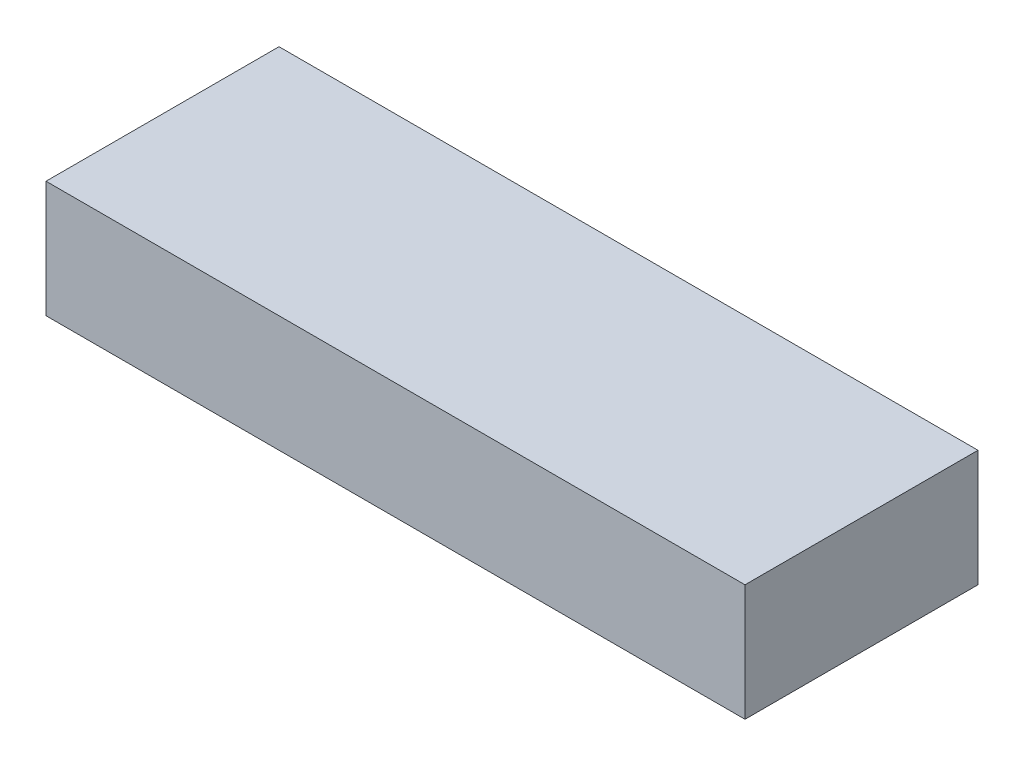
ISO-10303-21;
HEADER;
FILE_DESCRIPTION(('STEP AP214'),'2;1');
FILE_NAME('part.step','',(''),(''),'','','');
FILE_SCHEMA(('AUTOMOTIVE_DESIGN { 1 0 10303 214 1 1 1 1 }'));
ENDSEC;
DATA;
#1=APPLICATION_CONTEXT('core data for automotive mechanical design processes');
#2=APPLICATION_PROTOCOL_DEFINITION('international standard','automotive_design',2000,#1);
#3=PRODUCT_CONTEXT('',#1,'mechanical');
#4=PRODUCT('Part','Part','',(#3));
#5=PRODUCT_RELATED_PRODUCT_CATEGORY('part','',(#4));
#6=PRODUCT_DEFINITION_FORMATION('','',#4);
#7=PRODUCT_DEFINITION_CONTEXT('part definition',#1,'design');
#8=PRODUCT_DEFINITION('design','',#6,#7);
#9=PRODUCT_DEFINITION_SHAPE('','',#8);
#10=(LENGTH_UNIT() NAMED_UNIT(*) SI_UNIT(.MILLI.,.METRE.));
#11=(NAMED_UNIT(*) PLANE_ANGLE_UNIT() SI_UNIT($,.RADIAN.));
#12=(NAMED_UNIT(*) SI_UNIT($,.STERADIAN.) SOLID_ANGLE_UNIT());
#13=UNCERTAINTY_MEASURE_WITH_UNIT(LENGTH_MEASURE(1.E-05),#10,'distance_accuracy_value','');
#14=(GEOMETRIC_REPRESENTATION_CONTEXT(3) GLOBAL_UNCERTAINTY_ASSIGNED_CONTEXT((#13)) GLOBAL_UNIT_ASSIGNED_CONTEXT((#10,
#11,#12)) REPRESENTATION_CONTEXT('',''));
#15=CARTESIAN_POINT('',(0.,0.,0.));
#16=DIRECTION('',(0.,0.,1.));
#17=DIRECTION('',(1.,0.,0.));
#18=AXIS2_PLACEMENT_3D('',#15,#16,#17);
#19=CARTESIAN_POINT('',(0.,5.,0.));
#20=DIRECTION('',(1.,0.,0.));
#21=DIRECTION('',(0.,0.,-1.));
#22=AXIS2_PLACEMENT_3D('',#19,#20,#21);
#23=PLANE('',#22);
#24=DIRECTION('',(0.,0.,1.));
#25=VECTOR('',#24,1.);
#26=CARTESIAN_POINT('',(0.,0.,0.));
#27=LINE('',#26,#25);
#28=CARTESIAN_POINT('',(0.,0.,-10.));
#29=VERTEX_POINT('',#28);
#30=CARTESIAN_POINT('',(0.,0.,0.));
#31=VERTEX_POINT('',#30);
#32=EDGE_CURVE('E107',#29,#31,#27,.T.);
#33=ORIENTED_EDGE('',*,*,#32,.T.);
#34=DIRECTION('',(0.,-1.,0.));
#35=VECTOR('',#34,1.);
#36=CARTESIAN_POINT('',(0.,5.,0.));
#37=LINE('',#36,#35);
#38=CARTESIAN_POINT('',(0.,5.,0.));
#39=VERTEX_POINT('',#38);
#40=EDGE_CURVE('E11',#39,#31,#37,.T.);
#41=ORIENTED_EDGE('',*,*,#40,.F.);
#42=DIRECTION('',(0.,0.,1.));
#43=VECTOR('',#42,1.);
#44=CARTESIAN_POINT('',(0.,5.,0.));
#45=LINE('',#44,#43);
#46=CARTESIAN_POINT('',(0.,5.,-10.));
#47=VERTEX_POINT('',#46);
#48=EDGE_CURVE('E91',#47,#39,#45,.T.);
#49=ORIENTED_EDGE('',*,*,#48,.F.);
#50=DIRECTION('',(0.,-1.,0.));
#51=VECTOR('',#50,1.);
#52=CARTESIAN_POINT('',(0.,5.,-10.));
#53=LINE('',#52,#51);
#54=EDGE_CURVE('E103',#47,#29,#53,.T.);
#55=ORIENTED_EDGE('',*,*,#54,.T.);
#56=EDGE_LOOP('',(#33,#41,#49,#55));
#57=FACE_BOUND('',#56,.T.);
#58=ADVANCED_FACE('F39',(#57),#23,.F.);
#59=CARTESIAN_POINT('',(0.,5.,0.));
#60=DIRECTION('',(0.,0.,-1.));
#61=DIRECTION('',(-1.,0.,0.));
#62=AXIS2_PLACEMENT_3D('',#59,#60,#61);
#63=PLANE('',#62);
#64=DIRECTION('',(1.,0.,0.));
#65=VECTOR('',#64,1.);
#66=CARTESIAN_POINT('',(0.,0.,0.));
#67=LINE('',#66,#65);
#68=CARTESIAN_POINT('',(30.,0.,0.));
#69=VERTEX_POINT('',#68);
#70=EDGE_CURVE('E96',#31,#69,#67,.T.);
#71=ORIENTED_EDGE('',*,*,#70,.T.);
#72=DIRECTION('',(0.,-1.,0.));
#73=VECTOR('',#72,1.);
#74=CARTESIAN_POINT('',(30.,5.,0.));
#75=LINE('',#74,#73);
#76=CARTESIAN_POINT('',(30.,5.,0.));
#77=VERTEX_POINT('',#76);
#78=EDGE_CURVE('E48',#77,#69,#75,.T.);
#79=ORIENTED_EDGE('',*,*,#78,.F.);
#80=DIRECTION('',(1.,0.,0.));
#81=VECTOR('',#80,1.);
#82=CARTESIAN_POINT('',(0.,5.,0.));
#83=LINE('',#82,#81);
#84=EDGE_CURVE('E86',#39,#77,#83,.T.);
#85=ORIENTED_EDGE('',*,*,#84,.F.);
#86=ORIENTED_EDGE('',*,*,#40,.T.);
#87=EDGE_LOOP('',(#71,#79,#85,#86));
#88=FACE_BOUND('',#87,.T.);
#89=ADVANCED_FACE('F95',(#88),#63,.F.);
#90=CARTESIAN_POINT('',(30.,5.,0.));
#91=DIRECTION('',(-1.,0.,0.));
#92=DIRECTION('',(0.,0.,1.));
#93=AXIS2_PLACEMENT_3D('',#90,#91,#92);
#94=PLANE('',#93);
#95=DIRECTION('',(0.,0.,-1.));
#96=VECTOR('',#95,1.);
#97=CARTESIAN_POINT('',(30.,0.,0.));
#98=LINE('',#97,#96);
#99=CARTESIAN_POINT('',(30.,0.,-10.));
#100=VERTEX_POINT('',#99);
#101=EDGE_CURVE('E73',#69,#100,#98,.T.);
#102=ORIENTED_EDGE('',*,*,#101,.T.);
#103=DIRECTION('',(0.,-1.,0.));
#104=VECTOR('',#103,1.);
#105=CARTESIAN_POINT('',(30.,5.,-10.));
#106=LINE('',#105,#104);
#107=CARTESIAN_POINT('',(30.,5.,-10.));
#108=VERTEX_POINT('',#107);
#109=EDGE_CURVE('E98',#108,#100,#106,.T.);
#110=ORIENTED_EDGE('',*,*,#109,.F.);
#111=DIRECTION('',(0.,0.,-1.));
#112=VECTOR('',#111,1.);
#113=CARTESIAN_POINT('',(30.,5.,0.));
#114=LINE('',#113,#112);
#115=EDGE_CURVE('E89',#77,#108,#114,.T.);
#116=ORIENTED_EDGE('',*,*,#115,.F.);
#117=ORIENTED_EDGE('',*,*,#78,.T.);
#118=EDGE_LOOP('',(#102,#110,#116,#117));
#119=FACE_BOUND('',#118,.T.);
#120=ADVANCED_FACE('F99',(#119),#94,.F.);
#121=CARTESIAN_POINT('',(0.,5.,-10.));
#122=DIRECTION('',(0.,0.,1.));
#123=DIRECTION('',(1.,0.,0.));
#124=AXIS2_PLACEMENT_3D('',#121,#122,#123);
#125=PLANE('',#124);
#126=DIRECTION('',(-1.,0.,0.));
#127=VECTOR('',#126,1.);
#128=CARTESIAN_POINT('',(0.,0.,-10.));
#129=LINE('',#128,#127);
#130=EDGE_CURVE('E79',#100,#29,#129,.T.);
#131=ORIENTED_EDGE('',*,*,#130,.T.);
#132=ORIENTED_EDGE('',*,*,#54,.F.);
#133=DIRECTION('',(-1.,0.,0.));
#134=VECTOR('',#133,1.);
#135=CARTESIAN_POINT('',(0.,5.,-10.));
#136=LINE('',#135,#134);
#137=EDGE_CURVE('E56',#108,#47,#136,.T.);
#138=ORIENTED_EDGE('',*,*,#137,.F.);
#139=ORIENTED_EDGE('',*,*,#109,.T.);
#140=EDGE_LOOP('',(#131,#132,#138,#139));
#141=FACE_BOUND('',#140,.T.);
#142=ADVANCED_FACE('F120',(#141),#125,.F.);
#143=CARTESIAN_POINT('',(0.,5.,0.));
#144=DIRECTION('',(0.,-1.,0.));
#145=DIRECTION('',(0.,0.,-1.));
#146=AXIS2_PLACEMENT_3D('',#143,#144,#145);
#147=PLANE('',#146);
#148=ORIENTED_EDGE('',*,*,#48,.T.);
#149=ORIENTED_EDGE('',*,*,#84,.T.);
#150=ORIENTED_EDGE('',*,*,#115,.T.);
#151=ORIENTED_EDGE('',*,*,#137,.T.);
#152=EDGE_LOOP('',(#148,#149,#150,#151));
#153=FACE_BOUND('',#152,.T.);
#154=ADVANCED_FACE('F87',(#153),#147,.F.);
#155=CARTESIAN_POINT('',(0.,0.,0.));
#156=DIRECTION('',(0.,-1.,0.));
#157=DIRECTION('',(0.,0.,-1.));
#158=AXIS2_PLACEMENT_3D('',#155,#156,#157);
#159=PLANE('',#158);
#160=ORIENTED_EDGE('',*,*,#32,.F.);
#161=ORIENTED_EDGE('',*,*,#130,.F.);
#162=ORIENTED_EDGE('',*,*,#101,.F.);
#163=ORIENTED_EDGE('',*,*,#70,.F.);
#164=EDGE_LOOP('',(#160,#161,#162,#163));
#165=FACE_BOUND('',#164,.T.);
#166=ADVANCED_FACE('F123',(#165),#159,.T.);
#167=CLOSED_SHELL('',(#58,#89,#120,#142,#154,#166));
#168=MANIFOLD_SOLID_BREP('B2',#167);
#169=ADVANCED_BREP_SHAPE_REPRESENTATION('',(#18,#168),#14);
#170=SHAPE_DEFINITION_REPRESENTATION(#9,#169);
ENDSEC;
END-ISO-10303-21;
